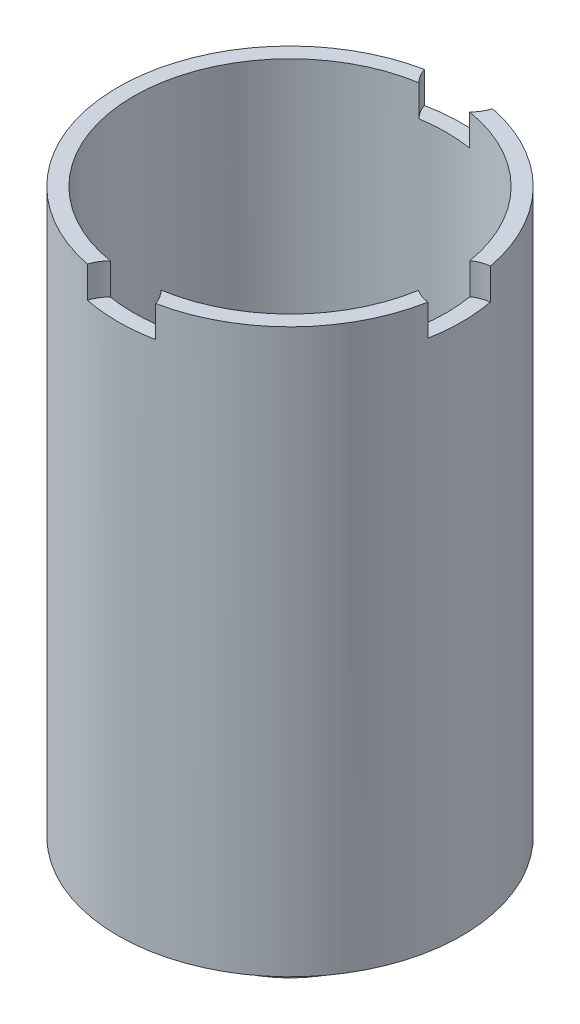
ISO-10303-21;
HEADER;
FILE_DESCRIPTION(('STEP AP214'),'2;1');
FILE_NAME('part.step','',(''),(''),'','','');
FILE_SCHEMA(('AUTOMOTIVE_DESIGN { 1 0 10303 214 1 1 1 1 }'));
ENDSEC;
DATA;
#1=APPLICATION_CONTEXT('core data for automotive mechanical design processes');
#2=APPLICATION_PROTOCOL_DEFINITION('international standard','automotive_design',2000,#1);
#3=PRODUCT_CONTEXT('',#1,'mechanical');
#4=PRODUCT('Part','Part','',(#3));
#5=PRODUCT_RELATED_PRODUCT_CATEGORY('part','',(#4));
#6=PRODUCT_DEFINITION_FORMATION('','',#4);
#7=PRODUCT_DEFINITION_CONTEXT('part definition',#1,'design');
#8=PRODUCT_DEFINITION('design','',#6,#7);
#9=PRODUCT_DEFINITION_SHAPE('','',#8);
#10=(LENGTH_UNIT() NAMED_UNIT(*) SI_UNIT(.MILLI.,.METRE.));
#11=(NAMED_UNIT(*) PLANE_ANGLE_UNIT() SI_UNIT($,.RADIAN.));
#12=(NAMED_UNIT(*) SI_UNIT($,.STERADIAN.) SOLID_ANGLE_UNIT());
#13=UNCERTAINTY_MEASURE_WITH_UNIT(LENGTH_MEASURE(1.E-05),#10,'distance_accuracy_value','');
#14=(GEOMETRIC_REPRESENTATION_CONTEXT(3) GLOBAL_UNCERTAINTY_ASSIGNED_CONTEXT((#13)) GLOBAL_UNIT_ASSIGNED_CONTEXT((#10,
#11,#12)) REPRESENTATION_CONTEXT('',''));
#15=CARTESIAN_POINT('',(0.,0.,0.));
#16=DIRECTION('',(0.,0.,1.));
#17=DIRECTION('',(1.,0.,0.));
#18=AXIS2_PLACEMENT_3D('',#15,#16,#17);
#19=CARTESIAN_POINT('',(0.,-18.,0.));
#20=DIRECTION('',(0.,1.,0.));
#21=DIRECTION('',(0.,0.,1.));
#22=AXIS2_PLACEMENT_3D('',#19,#20,#21);
#23=CYLINDRICAL_SURFACE('',#22,5.5);
#24=CARTESIAN_POINT('',(0.,-18.,0.));
#25=DIRECTION('',(0.,1.,0.));
#26=DIRECTION('',(0.,0.,1.));
#27=AXIS2_PLACEMENT_3D('',#24,#25,#26);
#28=CIRCLE('',#27,5.5);
#29=CARTESIAN_POINT('',(0.,-18.,5.5));
#30=VERTEX_POINT('',#29);
#31=EDGE_CURVE('E241',#30,#30,#28,.T.);
#32=ORIENTED_EDGE('',*,*,#31,.T.);
#33=EDGE_LOOP('',(#32));
#34=FACE_BOUND('',#33,.T.);
#35=CARTESIAN_POINT('',(0.,0.,0.));
#36=DIRECTION('',(0.,1.,0.));
#37=DIRECTION('',(0.,0.,1.));
#38=AXIS2_PLACEMENT_3D('',#35,#36,#37);
#39=CIRCLE('',#38,5.5);
#40=CARTESIAN_POINT('',(1.09234282825601,0.,5.3904347826087));
#41=VERTEX_POINT('',#40);
#42=CARTESIAN_POINT('',(5.40909090909091,0.,0.995859195463938));
#43=VERTEX_POINT('',#42);
#44=EDGE_CURVE('E286',#41,#43,#39,.T.);
#45=ORIENTED_EDGE('',*,*,#44,.F.);
#46=DIRECTION('',(0.,1.,0.));
#47=VECTOR('',#46,1.);
#48=CARTESIAN_POINT('',(1.09234282825601,-0.5,5.3904347826087));
#49=LINE('',#48,#47);
#50=CARTESIAN_POINT('',(1.09234282825601,-1.,5.3904347826087));
#51=VERTEX_POINT('',#50);
#52=EDGE_CURVE('E127',#41,#51,#49,.F.);
#53=ORIENTED_EDGE('',*,*,#52,.T.);
#54=CARTESIAN_POINT('',(0.,-1.,0.));
#55=DIRECTION('',(0.,-1.,0.));
#56=DIRECTION('',(0.,0.,-1.));
#57=AXIS2_PLACEMENT_3D('',#54,#55,#56);
#58=CIRCLE('',#57,5.5);
#59=CARTESIAN_POINT('',(-1.09234282825601,-1.,5.3904347826087));
#60=VERTEX_POINT('',#59);
#61=EDGE_CURVE('E204',#60,#51,#58,.F.);
#62=ORIENTED_EDGE('',*,*,#61,.F.);
#63=DIRECTION('',(0.,1.,0.));
#64=VECTOR('',#63,1.);
#65=CARTESIAN_POINT('',(-1.09234282825601,-0.5,5.3904347826087));
#66=LINE('',#65,#64);
#67=CARTESIAN_POINT('',(-1.09234282825601,0.,5.3904347826087));
#68=VERTEX_POINT('',#67);
#69=EDGE_CURVE('E201',#60,#68,#66,.T.);
#70=ORIENTED_EDGE('',*,*,#69,.T.);
#71=CARTESIAN_POINT('',(-1.09234282825601,0.,-5.3904347826087));
#72=VERTEX_POINT('',#71);
#73=EDGE_CURVE('E279',#72,#68,#39,.T.);
#74=ORIENTED_EDGE('',*,*,#73,.F.);
#75=DIRECTION('',(0.,1.,0.));
#76=VECTOR('',#75,1.);
#77=CARTESIAN_POINT('',(-1.09234282825601,-0.5,-5.3904347826087));
#78=LINE('',#77,#76);
#79=CARTESIAN_POINT('',(-1.09234282825601,-1.,-5.3904347826087));
#80=VERTEX_POINT('',#79);
#81=EDGE_CURVE('E185',#72,#80,#78,.F.);
#82=ORIENTED_EDGE('',*,*,#81,.T.);
#83=CARTESIAN_POINT('',(0.,-1.,0.));
#84=DIRECTION('',(0.,-1.,0.));
#85=DIRECTION('',(0.,0.,-1.));
#86=AXIS2_PLACEMENT_3D('',#83,#84,#85);
#87=CIRCLE('',#86,5.5);
#88=CARTESIAN_POINT('',(1.09234282825601,-1.,-5.3904347826087));
#89=VERTEX_POINT('',#88);
#90=EDGE_CURVE('E191',#89,#80,#87,.F.);
#91=ORIENTED_EDGE('',*,*,#90,.F.);
#92=DIRECTION('',(0.,1.,0.));
#93=VECTOR('',#92,1.);
#94=CARTESIAN_POINT('',(1.09234282825601,-0.5,-5.3904347826087));
#95=LINE('',#94,#93);
#96=CARTESIAN_POINT('',(1.09234282825601,0.,-5.3904347826087));
#97=VERTEX_POINT('',#96);
#98=EDGE_CURVE('E188',#89,#97,#95,.T.);
#99=ORIENTED_EDGE('',*,*,#98,.T.);
#100=CARTESIAN_POINT('',(5.40909090909091,0.,-0.995859195463938));
#101=VERTEX_POINT('',#100);
#102=EDGE_CURVE('E251',#101,#97,#39,.T.);
#103=ORIENTED_EDGE('',*,*,#102,.F.);
#104=DIRECTION('',(0.,1.,0.));
#105=VECTOR('',#104,1.);
#106=CARTESIAN_POINT('',(5.40909090909091,-0.5,-0.995859195463938));
#107=LINE('',#106,#105);
#108=CARTESIAN_POINT('',(5.40909090909091,-1.,-0.995859195463938));
#109=VERTEX_POINT('',#108);
#110=EDGE_CURVE('E171',#101,#109,#107,.F.);
#111=ORIENTED_EDGE('',*,*,#110,.T.);
#112=CARTESIAN_POINT('',(0.,-1.,0.));
#113=DIRECTION('',(0.,-1.,0.));
#114=DIRECTION('',(0.,0.,-1.));
#115=AXIS2_PLACEMENT_3D('',#112,#113,#114);
#116=CIRCLE('',#115,5.5);
#117=CARTESIAN_POINT('',(5.40909090909091,-1.,0.995859195463938));
#118=VERTEX_POINT('',#117);
#119=EDGE_CURVE('E177',#118,#109,#116,.F.);
#120=ORIENTED_EDGE('',*,*,#119,.F.);
#121=DIRECTION('',(0.,1.,0.));
#122=VECTOR('',#121,1.);
#123=CARTESIAN_POINT('',(5.40909090909091,-0.5,0.995859195463938));
#124=LINE('',#123,#122);
#125=EDGE_CURVE('E174',#118,#43,#124,.T.);
#126=ORIENTED_EDGE('',*,*,#125,.T.);
#127=EDGE_LOOP('',(#45,#53,#62,#70,#74,#82,#91,#99,#103,#111,#120,#126));
#128=FACE_BOUND('',#127,.T.);
#129=ADVANCED_FACE('F36',(#34,#128),#23,.T.);
#130=CARTESIAN_POINT('',(0.,0.,0.));
#131=DIRECTION('',(0.,1.,0.));
#132=DIRECTION('',(0.,0.,1.));
#133=AXIS2_PLACEMENT_3D('',#130,#131,#132);
#134=PLANE('',#133);
#135=ORIENTED_EDGE('',*,*,#73,.T.);
#136=CARTESIAN_POINT('',(0.,0.,5.75));
#137=DIRECTION('',(0.,-1.,0.));
#138=DIRECTION('',(0.,0.,-1.));
#139=AXIS2_PLACEMENT_3D('',#136,#137,#138);
#140=CIRCLE('',#139,1.15);
#141=CARTESIAN_POINT('',(-0.810248159143288,0.,4.93391304347826));
#142=VERTEX_POINT('',#141);
#143=EDGE_CURVE('E132',#68,#142,#140,.T.);
#144=ORIENTED_EDGE('',*,*,#143,.T.);
#145=CARTESIAN_POINT('',(0.,0.,0.));
#146=DIRECTION('',(0.,1.,0.));
#147=DIRECTION('',(0.,0.,1.));
#148=AXIS2_PLACEMENT_3D('',#145,#146,#147);
#149=CIRCLE('',#148,5.);
#150=CARTESIAN_POINT('',(-0.810248159143285,0.,-4.93391304347826));
#151=VERTEX_POINT('',#150);
#152=EDGE_CURVE('E145',#151,#142,#149,.T.);
#153=ORIENTED_EDGE('',*,*,#152,.F.);
#154=CARTESIAN_POINT('',(0.,0.,-5.75));
#155=DIRECTION('',(0.,-1.,0.));
#156=DIRECTION('',(0.,0.,-1.));
#157=AXIS2_PLACEMENT_3D('',#154,#155,#156);
#158=CIRCLE('',#157,1.15);
#159=EDGE_CURVE('E197',#151,#72,#158,.T.);
#160=ORIENTED_EDGE('',*,*,#159,.T.);
#161=EDGE_LOOP('',(#135,#144,#153,#160));
#162=FACE_BOUND('',#161,.T.);
#163=ADVANCED_FACE('F276',(#162),#134,.T.);
#164=CARTESIAN_POINT('',(0.810248159143288,0.,4.93391304347826));
#165=VERTEX_POINT('',#164);
#166=CARTESIAN_POINT('',(4.93181818181818,0.,0.82290304501053));
#167=VERTEX_POINT('',#166);
#168=EDGE_CURVE('E137',#165,#167,#149,.T.);
#169=ORIENTED_EDGE('',*,*,#168,.F.);
#170=EDGE_CURVE('E122',#165,#41,#140,.T.);
#171=ORIENTED_EDGE('',*,*,#170,.T.);
#172=ORIENTED_EDGE('',*,*,#44,.T.);
#173=CARTESIAN_POINT('',(5.5,0.,0.));
#174=DIRECTION('',(0.,-1.,0.));
#175=DIRECTION('',(0.,0.,-1.));
#176=AXIS2_PLACEMENT_3D('',#173,#174,#175);
#177=CIRCLE('',#176,1.);
#178=EDGE_CURVE('E144',#43,#167,#177,.T.);
#179=ORIENTED_EDGE('',*,*,#178,.T.);
#180=EDGE_LOOP('',(#169,#171,#172,#179));
#181=FACE_BOUND('',#180,.T.);
#182=ADVANCED_FACE('F142',(#181),#134,.T.);
#183=CARTESIAN_POINT('',(0.,-18.,0.));
#184=DIRECTION('',(0.,1.,0.));
#185=DIRECTION('',(0.,0.,1.));
#186=AXIS2_PLACEMENT_3D('',#183,#184,#185);
#187=CYLINDRICAL_SURFACE('',#186,5.);
#188=CARTESIAN_POINT('',(0.,-17.5,0.));
#189=DIRECTION('',(0.,1.,0.));
#190=DIRECTION('',(0.,0.,1.));
#191=AXIS2_PLACEMENT_3D('',#188,#189,#190);
#192=CIRCLE('',#191,5.);
#193=CARTESIAN_POINT('',(0.,-17.5,5.));
#194=VERTEX_POINT('',#193);
#195=EDGE_CURVE('E155',#194,#194,#192,.T.);
#196=ORIENTED_EDGE('',*,*,#195,.F.);
#197=EDGE_LOOP('',(#196));
#198=FACE_BOUND('',#197,.T.);
#199=DIRECTION('',(0.,1.,0.));
#200=VECTOR('',#199,1.);
#201=CARTESIAN_POINT('',(0.810248159143288,-0.5,4.93391304347826));
#202=LINE('',#201,#200);
#203=CARTESIAN_POINT('',(0.810248159143288,-1.,4.93391304347826));
#204=VERTEX_POINT('',#203);
#205=EDGE_CURVE('E11',#165,#204,#202,.F.);
#206=ORIENTED_EDGE('',*,*,#205,.F.);
#207=ORIENTED_EDGE('',*,*,#168,.T.);
#208=DIRECTION('',(0.,1.,0.));
#209=VECTOR('',#208,1.);
#210=CARTESIAN_POINT('',(4.93181818181818,-0.5,0.82290304501053));
#211=LINE('',#210,#209);
#212=CARTESIAN_POINT('',(4.93181818181818,-1.,0.82290304501053));
#213=VERTEX_POINT('',#212);
#214=EDGE_CURVE('E249',#213,#167,#211,.T.);
#215=ORIENTED_EDGE('',*,*,#214,.F.);
#216=CARTESIAN_POINT('',(0.,-1.,0.));
#217=DIRECTION('',(0.,-1.,0.));
#218=DIRECTION('',(0.,0.,-1.));
#219=AXIS2_PLACEMENT_3D('',#216,#217,#218);
#220=CIRCLE('',#219,5.);
#221=CARTESIAN_POINT('',(4.93181818181818,-1.,-0.82290304501053));
#222=VERTEX_POINT('',#221);
#223=EDGE_CURVE('E246',#213,#222,#220,.F.);
#224=ORIENTED_EDGE('',*,*,#223,.T.);
#225=DIRECTION('',(0.,1.,0.));
#226=VECTOR('',#225,1.);
#227=CARTESIAN_POINT('',(4.93181818181818,-0.5,-0.822903045010529));
#228=LINE('',#227,#226);
#229=CARTESIAN_POINT('',(4.93181818181818,0.,-0.82290304501053));
#230=VERTEX_POINT('',#229);
#231=EDGE_CURVE('E258',#230,#222,#228,.F.);
#232=ORIENTED_EDGE('',*,*,#231,.F.);
#233=CARTESIAN_POINT('',(0.810248159143287,0.,-4.93391304347826));
#234=VERTEX_POINT('',#233);
#235=EDGE_CURVE('E148',#230,#234,#149,.T.);
#236=ORIENTED_EDGE('',*,*,#235,.T.);
#237=DIRECTION('',(0.,1.,0.));
#238=VECTOR('',#237,1.);
#239=CARTESIAN_POINT('',(0.810248159143288,-0.5,-4.93391304347826));
#240=LINE('',#239,#238);
#241=CARTESIAN_POINT('',(0.810248159143287,-1.,-4.93391304347826));
#242=VERTEX_POINT('',#241);
#243=EDGE_CURVE('E264',#242,#234,#240,.T.);
#244=ORIENTED_EDGE('',*,*,#243,.F.);
#245=CARTESIAN_POINT('',(0.,-1.,0.));
#246=DIRECTION('',(0.,-1.,0.));
#247=DIRECTION('',(0.,0.,-1.));
#248=AXIS2_PLACEMENT_3D('',#245,#246,#247);
#249=CIRCLE('',#248,5.);
#250=CARTESIAN_POINT('',(-0.810248159143285,-1.,-4.93391304347826));
#251=VERTEX_POINT('',#250);
#252=EDGE_CURVE('E261',#242,#251,#249,.F.);
#253=ORIENTED_EDGE('',*,*,#252,.T.);
#254=DIRECTION('',(0.,1.,0.));
#255=VECTOR('',#254,1.);
#256=CARTESIAN_POINT('',(-0.810248159143286,-0.5,-4.93391304347826));
#257=LINE('',#256,#255);
#258=EDGE_CURVE('E266',#151,#251,#257,.F.);
#259=ORIENTED_EDGE('',*,*,#258,.F.);
#260=ORIENTED_EDGE('',*,*,#152,.T.);
#261=DIRECTION('',(0.,1.,0.));
#262=VECTOR('',#261,1.);
#263=CARTESIAN_POINT('',(-0.810248159143288,-0.5,4.93391304347826));
#264=LINE('',#263,#262);
#265=CARTESIAN_POINT('',(-0.810248159143288,-1.,4.93391304347826));
#266=VERTEX_POINT('',#265);
#267=EDGE_CURVE('E43',#266,#142,#264,.T.);
#268=ORIENTED_EDGE('',*,*,#267,.F.);
#269=CARTESIAN_POINT('',(0.,-1.,0.));
#270=DIRECTION('',(0.,-1.,0.));
#271=DIRECTION('',(0.,0.,-1.));
#272=AXIS2_PLACEMENT_3D('',#269,#270,#271);
#273=CIRCLE('',#272,5.);
#274=EDGE_CURVE('E140',#266,#204,#273,.F.);
#275=ORIENTED_EDGE('',*,*,#274,.T.);
#276=EDGE_LOOP('',(#206,#207,#215,#224,#232,#236,#244,#253,#259,#260,#268,#275));
#277=FACE_BOUND('',#276,.T.);
#278=ADVANCED_FACE('F135',(#198,#277),#187,.F.);
#279=ORIENTED_EDGE('',*,*,#102,.T.);
#280=EDGE_CURVE('E194',#97,#234,#158,.T.);
#281=ORIENTED_EDGE('',*,*,#280,.T.);
#282=ORIENTED_EDGE('',*,*,#235,.F.);
#283=EDGE_CURVE('E182',#230,#101,#177,.T.);
#284=ORIENTED_EDGE('',*,*,#283,.T.);
#285=EDGE_LOOP('',(#279,#281,#282,#284));
#286=FACE_BOUND('',#285,.T.);
#287=ADVANCED_FACE('F232',(#286),#134,.T.);
#288=CARTESIAN_POINT('',(0.,-18.,0.));
#289=DIRECTION('',(0.,1.,0.));
#290=DIRECTION('',(0.,0.,1.));
#291=AXIS2_PLACEMENT_3D('',#288,#289,#290);
#292=PLANE('',#291);
#293=CARTESIAN_POINT('',(0.,-18.,-4.17675231011953));
#294=DIRECTION('',(0.,-1.,0.));
#295=DIRECTION('',(0.,0.,1.));
#296=AXIS2_PLACEMENT_3D('',#293,#294,#295);
#297=CIRCLE('',#296,0.5);
#298=CARTESIAN_POINT('',(0.,-18.,-3.67675231011953));
#299=VERTEX_POINT('',#298);
#300=EDGE_CURVE('E217',#299,#299,#297,.T.);
#301=ORIENTED_EDGE('',*,*,#300,.F.);
#302=EDGE_LOOP('',(#301));
#303=FACE_BOUND('',#302,.T.);
#304=CARTESIAN_POINT('',(4.17675231011953,-18.,0.));
#305=DIRECTION('',(0.,-1.,0.));
#306=DIRECTION('',(-1.,0.,0.));
#307=AXIS2_PLACEMENT_3D('',#304,#305,#306);
#308=CIRCLE('',#307,0.5);
#309=CARTESIAN_POINT('',(3.67675231011953,-18.,0.));
#310=VERTEX_POINT('',#309);
#311=EDGE_CURVE('E211',#310,#310,#308,.T.);
#312=ORIENTED_EDGE('',*,*,#311,.F.);
#313=EDGE_LOOP('',(#312));
#314=FACE_BOUND('',#313,.T.);
#315=CARTESIAN_POINT('',(0.,-18.,4.17675231011953));
#316=DIRECTION('',(0.,-1.,0.));
#317=DIRECTION('',(0.,0.,-1.));
#318=AXIS2_PLACEMENT_3D('',#315,#316,#317);
#319=CIRCLE('',#318,0.5);
#320=CARTESIAN_POINT('',(0.,-18.,3.67675231011953));
#321=VERTEX_POINT('',#320);
#322=EDGE_CURVE('E210',#321,#321,#319,.T.);
#323=ORIENTED_EDGE('',*,*,#322,.F.);
#324=EDGE_LOOP('',(#323));
#325=FACE_BOUND('',#324,.T.);
#326=ORIENTED_EDGE('',*,*,#31,.F.);
#327=EDGE_LOOP('',(#326));
#328=FACE_BOUND('',#327,.T.);
#329=CARTESIAN_POINT('',(0.,-18.,0.));
#330=DIRECTION('',(0.,1.,0.));
#331=DIRECTION('',(0.,0.,1.));
#332=AXIS2_PLACEMENT_3D('',#329,#330,#331);
#333=CIRCLE('',#332,3.);
#334=CARTESIAN_POINT('',(0.,-18.,3.));
#335=VERTEX_POINT('',#334);
#336=EDGE_CURVE('E244',#335,#335,#333,.F.);
#337=ORIENTED_EDGE('',*,*,#336,.F.);
#338=EDGE_LOOP('',(#337));
#339=FACE_BOUND('',#338,.T.);
#340=ADVANCED_FACE('F228',(#303,#314,#325,#328,#339),#292,.F.);
#341=CARTESIAN_POINT('',(0.,-19.8,0.));
#342=DIRECTION('',(0.,1.,0.));
#343=DIRECTION('',(0.,0.,1.));
#344=AXIS2_PLACEMENT_3D('',#341,#342,#343);
#345=CYLINDRICAL_SURFACE('',#344,3.);
#346=CARTESIAN_POINT('',(0.,-19.8,0.));
#347=DIRECTION('',(0.,-1.,0.));
#348=DIRECTION('',(0.,0.,-1.));
#349=AXIS2_PLACEMENT_3D('',#346,#347,#348);
#350=CIRCLE('',#349,3.);
#351=CARTESIAN_POINT('',(0.,-19.8,-3.));
#352=VERTEX_POINT('',#351);
#353=EDGE_CURVE('E165',#352,#352,#350,.T.);
#354=ORIENTED_EDGE('',*,*,#353,.F.);
#355=EDGE_LOOP('',(#354));
#356=FACE_BOUND('',#355,.T.);
#357=ORIENTED_EDGE('',*,*,#336,.T.);
#358=EDGE_LOOP('',(#357));
#359=FACE_BOUND('',#358,.T.);
#360=ADVANCED_FACE('F231',(#356,#359),#345,.T.);
#361=CARTESIAN_POINT('',(0.,-19.8,0.));
#362=DIRECTION('',(0.,-1.,0.));
#363=DIRECTION('',(0.,0.,-1.));
#364=AXIS2_PLACEMENT_3D('',#361,#362,#363);
#365=PLANE('',#364);
#366=CARTESIAN_POINT('',(0.,-19.8,0.));
#367=DIRECTION('',(0.,-1.,0.));
#368=DIRECTION('',(0.,0.,-1.));
#369=AXIS2_PLACEMENT_3D('',#366,#367,#368);
#370=CIRCLE('',#369,1.25);
#371=CARTESIAN_POINT('',(0.,-19.8,-1.25));
#372=VERTEX_POINT('',#371);
#373=EDGE_CURVE('E168',#372,#372,#370,.T.);
#374=ORIENTED_EDGE('',*,*,#373,.F.);
#375=EDGE_LOOP('',(#374));
#376=FACE_BOUND('',#375,.T.);
#377=ORIENTED_EDGE('',*,*,#353,.T.);
#378=EDGE_LOOP('',(#377));
#379=FACE_BOUND('',#378,.T.);
#380=ADVANCED_FACE('F291',(#376,#379),#365,.T.);
#381=CARTESIAN_POINT('',(0.,-17.5,0.));
#382=DIRECTION('',(0.,1.,0.));
#383=DIRECTION('',(0.,0.,1.));
#384=AXIS2_PLACEMENT_3D('',#381,#382,#383);
#385=PLANE('',#384);
#386=CARTESIAN_POINT('',(0.,-17.5,-4.17675231011953));
#387=DIRECTION('',(0.,1.,0.));
#388=DIRECTION('',(0.,0.,1.));
#389=AXIS2_PLACEMENT_3D('',#386,#387,#388);
#390=CIRCLE('',#389,0.5);
#391=CARTESIAN_POINT('',(0.,-17.5,-3.67675231011953));
#392=VERTEX_POINT('',#391);
#393=EDGE_CURVE('E220',#392,#392,#390,.F.);
#394=ORIENTED_EDGE('',*,*,#393,.T.);
#395=EDGE_LOOP('',(#394));
#396=FACE_BOUND('',#395,.T.);
#397=CARTESIAN_POINT('',(4.17675231011953,-17.5,0.));
#398=DIRECTION('',(0.,1.,0.));
#399=DIRECTION('',(0.,0.,1.));
#400=AXIS2_PLACEMENT_3D('',#397,#398,#399);
#401=CIRCLE('',#400,0.5);
#402=CARTESIAN_POINT('',(4.17675231011953,-17.5,0.499999999999985));
#403=VERTEX_POINT('',#402);
#404=EDGE_CURVE('E214',#403,#403,#401,.F.);
#405=ORIENTED_EDGE('',*,*,#404,.T.);
#406=EDGE_LOOP('',(#405));
#407=FACE_BOUND('',#406,.T.);
#408=CARTESIAN_POINT('',(0.,-17.5,4.17675231011953));
#409=DIRECTION('',(0.,1.,0.));
#410=DIRECTION('',(0.,0.,1.));
#411=AXIS2_PLACEMENT_3D('',#408,#409,#410);
#412=CIRCLE('',#411,0.5);
#413=CARTESIAN_POINT('',(0.,-17.5,4.67675231011953));
#414=VERTEX_POINT('',#413);
#415=EDGE_CURVE('E207',#414,#414,#412,.F.);
#416=ORIENTED_EDGE('',*,*,#415,.T.);
#417=EDGE_LOOP('',(#416));
#418=FACE_BOUND('',#417,.T.);
#419=ORIENTED_EDGE('',*,*,#195,.T.);
#420=EDGE_LOOP('',(#419));
#421=FACE_BOUND('',#420,.T.);
#422=CARTESIAN_POINT('',(0.,-17.5,0.));
#423=DIRECTION('',(0.,1.,0.));
#424=DIRECTION('',(0.,0.,1.));
#425=AXIS2_PLACEMENT_3D('',#422,#423,#424);
#426=CIRCLE('',#425,2.5);
#427=CARTESIAN_POINT('',(0.,-17.5,2.5));
#428=VERTEX_POINT('',#427);
#429=EDGE_CURVE('E160',#428,#428,#426,.F.);
#430=ORIENTED_EDGE('',*,*,#429,.T.);
#431=EDGE_LOOP('',(#430));
#432=FACE_BOUND('',#431,.T.);
#433=ADVANCED_FACE('F298',(#396,#407,#418,#421,#432),#385,.T.);
#434=CARTESIAN_POINT('',(0.,-19.8,0.));
#435=DIRECTION('',(0.,1.,0.));
#436=DIRECTION('',(0.,0.,1.));
#437=AXIS2_PLACEMENT_3D('',#434,#435,#436);
#438=CYLINDRICAL_SURFACE('',#437,2.5);
#439=CARTESIAN_POINT('',(0.,-19.3,0.));
#440=DIRECTION('',(0.,-1.,0.));
#441=DIRECTION('',(0.,0.,-1.));
#442=AXIS2_PLACEMENT_3D('',#439,#440,#441);
#443=CIRCLE('',#442,2.5);
#444=CARTESIAN_POINT('',(0.,-19.3,-2.5));
#445=VERTEX_POINT('',#444);
#446=EDGE_CURVE('E146',#445,#445,#443,.T.);
#447=ORIENTED_EDGE('',*,*,#446,.T.);
#448=EDGE_LOOP('',(#447));
#449=FACE_BOUND('',#448,.T.);
#450=ORIENTED_EDGE('',*,*,#429,.F.);
#451=EDGE_LOOP('',(#450));
#452=FACE_BOUND('',#451,.T.);
#453=ADVANCED_FACE('F349',(#449,#452),#438,.F.);
#454=CARTESIAN_POINT('',(0.,-19.3,0.));
#455=DIRECTION('',(0.,-1.,0.));
#456=DIRECTION('',(0.,0.,-1.));
#457=AXIS2_PLACEMENT_3D('',#454,#455,#456);
#458=PLANE('',#457);
#459=CARTESIAN_POINT('',(0.,-19.3,0.));
#460=DIRECTION('',(0.,-1.,0.));
#461=DIRECTION('',(0.,0.,-1.));
#462=AXIS2_PLACEMENT_3D('',#459,#460,#461);
#463=CIRCLE('',#462,1.25);
#464=CARTESIAN_POINT('',(0.,-19.3,-1.25));
#465=VERTEX_POINT('',#464);
#466=EDGE_CURVE('E151',#465,#465,#463,.T.);
#467=ORIENTED_EDGE('',*,*,#466,.T.);
#468=EDGE_LOOP('',(#467));
#469=FACE_BOUND('',#468,.T.);
#470=ORIENTED_EDGE('',*,*,#446,.F.);
#471=EDGE_LOOP('',(#470));
#472=FACE_BOUND('',#471,.T.);
#473=ADVANCED_FACE('F346',(#469,#472),#458,.F.);
#474=CARTESIAN_POINT('',(0.,0.,0.));
#475=DIRECTION('',(0.,-1.,0.));
#476=DIRECTION('',(0.,0.,-1.));
#477=AXIS2_PLACEMENT_3D('',#474,#475,#476);
#478=CYLINDRICAL_SURFACE('',#477,1.25);
#479=ORIENTED_EDGE('',*,*,#373,.T.);
#480=EDGE_LOOP('',(#479));
#481=FACE_BOUND('',#480,.T.);
#482=ORIENTED_EDGE('',*,*,#466,.F.);
#483=EDGE_LOOP('',(#482));
#484=FACE_BOUND('',#483,.T.);
#485=ADVANCED_FACE('F342',(#481,#484),#478,.F.);
#486=CARTESIAN_POINT('',(5.5,-1.,0.));
#487=DIRECTION('',(0.,1.,0.));
#488=DIRECTION('',(0.,0.,1.));
#489=AXIS2_PLACEMENT_3D('',#486,#487,#488);
#490=CYLINDRICAL_SURFACE('',#489,1.);
#491=ORIENTED_EDGE('',*,*,#283,.F.);
#492=ORIENTED_EDGE('',*,*,#231,.T.);
#493=CARTESIAN_POINT('',(5.5,-1.,0.));
#494=DIRECTION('',(0.,-1.,0.));
#495=DIRECTION('',(0.,0.,-1.));
#496=AXIS2_PLACEMENT_3D('',#493,#494,#495);
#497=CIRCLE('',#496,1.);
#498=EDGE_CURVE('E181',#222,#109,#497,.T.);
#499=ORIENTED_EDGE('',*,*,#498,.T.);
#500=ORIENTED_EDGE('',*,*,#110,.F.);
#501=EDGE_LOOP('',(#491,#492,#499,#500));
#502=FACE_BOUND('',#501,.T.);
#503=ADVANCED_FACE('F339',(#502),#490,.F.);
#504=EDGE_CURVE('E179',#118,#213,#497,.T.);
#505=ORIENTED_EDGE('',*,*,#504,.T.);
#506=ORIENTED_EDGE('',*,*,#214,.T.);
#507=ORIENTED_EDGE('',*,*,#178,.F.);
#508=ORIENTED_EDGE('',*,*,#125,.F.);
#509=EDGE_LOOP('',(#505,#506,#507,#508));
#510=FACE_BOUND('',#509,.T.);
#511=ADVANCED_FACE('F337',(#510),#490,.F.);
#512=CARTESIAN_POINT('',(5.5,-1.,0.));
#513=DIRECTION('',(0.,-1.,0.));
#514=DIRECTION('',(0.,0.,-1.));
#515=AXIS2_PLACEMENT_3D('',#512,#513,#514);
#516=PLANE('',#515);
#517=ORIENTED_EDGE('',*,*,#119,.T.);
#518=ORIENTED_EDGE('',*,*,#498,.F.);
#519=ORIENTED_EDGE('',*,*,#223,.F.);
#520=ORIENTED_EDGE('',*,*,#504,.F.);
#521=EDGE_LOOP('',(#517,#518,#519,#520));
#522=FACE_BOUND('',#521,.T.);
#523=ADVANCED_FACE('F334',(#522),#516,.F.);
#524=CARTESIAN_POINT('',(0.,-1.,-5.75));
#525=DIRECTION('',(0.,1.,0.));
#526=DIRECTION('',(0.,0.,1.));
#527=AXIS2_PLACEMENT_3D('',#524,#525,#526);
#528=CYLINDRICAL_SURFACE('',#527,1.15);
#529=ORIENTED_EDGE('',*,*,#159,.F.);
#530=ORIENTED_EDGE('',*,*,#258,.T.);
#531=CARTESIAN_POINT('',(0.,-1.,-5.75));
#532=DIRECTION('',(0.,-1.,0.));
#533=DIRECTION('',(0.,0.,-1.));
#534=AXIS2_PLACEMENT_3D('',#531,#532,#533);
#535=CIRCLE('',#534,1.15);
#536=EDGE_CURVE('E57',#251,#80,#535,.T.);
#537=ORIENTED_EDGE('',*,*,#536,.T.);
#538=ORIENTED_EDGE('',*,*,#81,.F.);
#539=EDGE_LOOP('',(#529,#530,#537,#538));
#540=FACE_BOUND('',#539,.T.);
#541=ADVANCED_FACE('F282',(#540),#528,.F.);
#542=EDGE_CURVE('E193',#89,#242,#535,.T.);
#543=ORIENTED_EDGE('',*,*,#542,.T.);
#544=ORIENTED_EDGE('',*,*,#243,.T.);
#545=ORIENTED_EDGE('',*,*,#280,.F.);
#546=ORIENTED_EDGE('',*,*,#98,.F.);
#547=EDGE_LOOP('',(#543,#544,#545,#546));
#548=FACE_BOUND('',#547,.T.);
#549=ADVANCED_FACE('F321',(#548),#528,.F.);
#550=CARTESIAN_POINT('',(0.,-1.,-5.75));
#551=DIRECTION('',(0.,-1.,0.));
#552=DIRECTION('',(0.,0.,-1.));
#553=AXIS2_PLACEMENT_3D('',#550,#551,#552);
#554=PLANE('',#553);
#555=ORIENTED_EDGE('',*,*,#90,.T.);
#556=ORIENTED_EDGE('',*,*,#536,.F.);
#557=ORIENTED_EDGE('',*,*,#252,.F.);
#558=ORIENTED_EDGE('',*,*,#542,.F.);
#559=EDGE_LOOP('',(#555,#556,#557,#558));
#560=FACE_BOUND('',#559,.T.);
#561=ADVANCED_FACE('F322',(#560),#554,.F.);
#562=CARTESIAN_POINT('',(0.,-1.,5.75));
#563=DIRECTION('',(0.,1.,0.));
#564=DIRECTION('',(0.,0.,1.));
#565=AXIS2_PLACEMENT_3D('',#562,#563,#564);
#566=CYLINDRICAL_SURFACE('',#565,1.15);
#567=ORIENTED_EDGE('',*,*,#170,.F.);
#568=ORIENTED_EDGE('',*,*,#205,.T.);
#569=CARTESIAN_POINT('',(0.,-1.,5.75));
#570=DIRECTION('',(0.,-1.,0.));
#571=DIRECTION('',(0.,0.,-1.));
#572=AXIS2_PLACEMENT_3D('',#569,#570,#571);
#573=CIRCLE('',#572,1.15);
#574=EDGE_CURVE('E50',#204,#51,#573,.T.);
#575=ORIENTED_EDGE('',*,*,#574,.T.);
#576=ORIENTED_EDGE('',*,*,#52,.F.);
#577=EDGE_LOOP('',(#567,#568,#575,#576));
#578=FACE_BOUND('',#577,.T.);
#579=ADVANCED_FACE('F124',(#578),#566,.F.);
#580=EDGE_CURVE('E131',#60,#266,#573,.T.);
#581=ORIENTED_EDGE('',*,*,#580,.T.);
#582=ORIENTED_EDGE('',*,*,#267,.T.);
#583=ORIENTED_EDGE('',*,*,#143,.F.);
#584=ORIENTED_EDGE('',*,*,#69,.F.);
#585=EDGE_LOOP('',(#581,#582,#583,#584));
#586=FACE_BOUND('',#585,.T.);
#587=ADVANCED_FACE('F271',(#586),#566,.F.);
#588=CARTESIAN_POINT('',(0.,-1.,5.75));
#589=DIRECTION('',(0.,-1.,0.));
#590=DIRECTION('',(0.,0.,-1.));
#591=AXIS2_PLACEMENT_3D('',#588,#589,#590);
#592=PLANE('',#591);
#593=ORIENTED_EDGE('',*,*,#61,.T.);
#594=ORIENTED_EDGE('',*,*,#574,.F.);
#595=ORIENTED_EDGE('',*,*,#274,.F.);
#596=ORIENTED_EDGE('',*,*,#580,.F.);
#597=EDGE_LOOP('',(#593,#594,#595,#596));
#598=FACE_BOUND('',#597,.T.);
#599=ADVANCED_FACE('F412',(#598),#592,.F.);
#600=CARTESIAN_POINT('',(0.,0.001000000000001,4.17675231011953));
#601=DIRECTION('',(0.,-1.,0.));
#602=DIRECTION('',(0.,0.,-1.));
#603=AXIS2_PLACEMENT_3D('',#600,#601,#602);
#604=CYLINDRICAL_SURFACE('',#603,0.5);
#605=ORIENTED_EDGE('',*,*,#415,.F.);
#606=EDGE_LOOP('',(#605));
#607=FACE_BOUND('',#606,.T.);
#608=ORIENTED_EDGE('',*,*,#322,.T.);
#609=EDGE_LOOP('',(#608));
#610=FACE_BOUND('',#609,.T.);
#611=ADVANCED_FACE('F420',(#607,#610),#604,.F.);
#612=CARTESIAN_POINT('',(4.17675231011953,0.001000000000001,0.));
#613=DIRECTION('',(0.,-1.,0.));
#614=DIRECTION('',(0.,0.,-1.));
#615=AXIS2_PLACEMENT_3D('',#612,#613,#614);
#616=CYLINDRICAL_SURFACE('',#615,0.5);
#617=ORIENTED_EDGE('',*,*,#404,.F.);
#618=EDGE_LOOP('',(#617));
#619=FACE_BOUND('',#618,.T.);
#620=ORIENTED_EDGE('',*,*,#311,.T.);
#621=EDGE_LOOP('',(#620));
#622=FACE_BOUND('',#621,.T.);
#623=ADVANCED_FACE('F428',(#619,#622),#616,.F.);
#624=CARTESIAN_POINT('',(0.,0.001000000000001,-4.17675231011953));
#625=DIRECTION('',(0.,-1.,0.));
#626=DIRECTION('',(0.,0.,-1.));
#627=AXIS2_PLACEMENT_3D('',#624,#625,#626);
#628=CYLINDRICAL_SURFACE('',#627,0.5);
#629=ORIENTED_EDGE('',*,*,#393,.F.);
#630=EDGE_LOOP('',(#629));
#631=FACE_BOUND('',#630,.T.);
#632=ORIENTED_EDGE('',*,*,#300,.T.);
#633=EDGE_LOOP('',(#632));
#634=FACE_BOUND('',#633,.T.);
#635=ADVANCED_FACE('F226',(#631,#634),#628,.F.);
#636=CLOSED_SHELL('',(#129,#163,#182,#278,#287,#340,#360,#380,#433,#453,#473,#485,#503,#511,
#523,#541,#549,#561,#579,#587,#599,#611,#623,#635));
#637=MANIFOLD_SOLID_BREP('B2',#636);
#638=ADVANCED_BREP_SHAPE_REPRESENTATION('',(#18,#637),#14);
#639=SHAPE_DEFINITION_REPRESENTATION(#9,#638);
ENDSEC;
END-ISO-10303-21;
